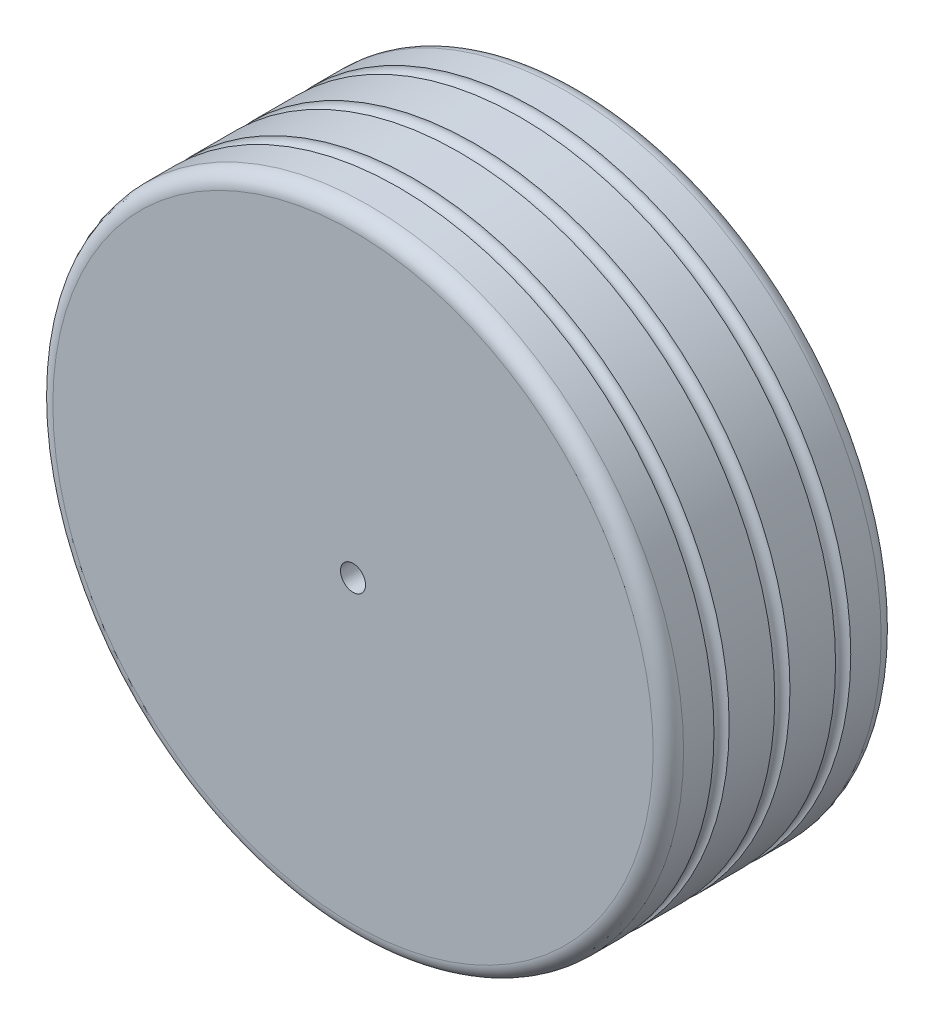
ISO-10303-21;
HEADER;
FILE_DESCRIPTION(('STEP AP214'),'2;1');
FILE_NAME('part.step','',(''),(''),'','','');
FILE_SCHEMA(('AUTOMOTIVE_DESIGN { 1 0 10303 214 1 1 1 1 }'));
ENDSEC;
DATA;
#1=APPLICATION_CONTEXT('core data for automotive mechanical design processes');
#2=APPLICATION_PROTOCOL_DEFINITION('international standard','automotive_design',2000,#1);
#3=PRODUCT_CONTEXT('',#1,'mechanical');
#4=PRODUCT('Part','Part','',(#3));
#5=PRODUCT_RELATED_PRODUCT_CATEGORY('part','',(#4));
#6=PRODUCT_DEFINITION_FORMATION('','',#4);
#7=PRODUCT_DEFINITION_CONTEXT('part definition',#1,'design');
#8=PRODUCT_DEFINITION('design','',#6,#7);
#9=PRODUCT_DEFINITION_SHAPE('','',#8);
#10=(LENGTH_UNIT() NAMED_UNIT(*) SI_UNIT(.MILLI.,.METRE.));
#11=(NAMED_UNIT(*) PLANE_ANGLE_UNIT() SI_UNIT($,.RADIAN.));
#12=(NAMED_UNIT(*) SI_UNIT($,.STERADIAN.) SOLID_ANGLE_UNIT());
#13=UNCERTAINTY_MEASURE_WITH_UNIT(LENGTH_MEASURE(1.E-05),#10,'distance_accuracy_value','');
#14=(GEOMETRIC_REPRESENTATION_CONTEXT(3) GLOBAL_UNCERTAINTY_ASSIGNED_CONTEXT((#13)) GLOBAL_UNIT_ASSIGNED_CONTEXT((#10,
#11,#12)) REPRESENTATION_CONTEXT('',''));
#15=CARTESIAN_POINT('',(0.,0.,0.));
#16=DIRECTION('',(0.,0.,1.));
#17=DIRECTION('',(1.,0.,0.));
#18=AXIS2_PLACEMENT_3D('',#15,#16,#17);
#19=CARTESIAN_POINT('',(0.,0.,30.));
#20=DIRECTION('',(0.,0.,-1.));
#21=DIRECTION('',(-1.,0.,0.));
#22=AXIS2_PLACEMENT_3D('',#19,#20,#21);
#23=CYLINDRICAL_SURFACE('',#22,41.5);
#24=CARTESIAN_POINT('',(0.,0.,22.));
#25=DIRECTION('',(0.,0.,1.));
#26=DIRECTION('',(1.,0.,0.));
#27=AXIS2_PLACEMENT_3D('',#24,#25,#26);
#28=CIRCLE('',#27,41.5);
#29=CARTESIAN_POINT('',(41.5,0.,22.));
#30=VERTEX_POINT('',#29);
#31=EDGE_CURVE('E39',#30,#30,#28,.F.);
#32=ORIENTED_EDGE('',*,*,#31,.T.);
#33=EDGE_LOOP('',(#32));
#34=FACE_BOUND('',#33,.T.);
#35=CARTESIAN_POINT('',(0.,0.,16.));
#36=DIRECTION('',(0.,0.,-1.));
#37=DIRECTION('',(-1.,0.,0.));
#38=AXIS2_PLACEMENT_3D('',#35,#36,#37);
#39=CIRCLE('',#38,41.5);
#40=CARTESIAN_POINT('',(-41.5,0.,16.));
#41=VERTEX_POINT('',#40);
#42=EDGE_CURVE('E60',#41,#41,#39,.F.);
#43=ORIENTED_EDGE('',*,*,#42,.T.);
#44=EDGE_LOOP('',(#43));
#45=FACE_BOUND('',#44,.T.);
#46=ADVANCED_FACE('F35',(#34,#45),#23,.T.);
#47=CARTESIAN_POINT('',(0.,0.,14.));
#48=DIRECTION('',(0.,0.,1.));
#49=DIRECTION('',(1.,0.,0.));
#50=AXIS2_PLACEMENT_3D('',#47,#48,#49);
#51=CIRCLE('',#50,41.5);
#52=CARTESIAN_POINT('',(41.5,0.,14.));
#53=VERTEX_POINT('',#52);
#54=EDGE_CURVE('E56',#53,#53,#51,.F.);
#55=ORIENTED_EDGE('',*,*,#54,.T.);
#56=EDGE_LOOP('',(#55));
#57=FACE_BOUND('',#56,.T.);
#58=CARTESIAN_POINT('',(0.,0.,8.));
#59=DIRECTION('',(0.,0.,-1.));
#60=DIRECTION('',(-1.,0.,0.));
#61=AXIS2_PLACEMENT_3D('',#58,#59,#60);
#62=CIRCLE('',#61,41.5);
#63=CARTESIAN_POINT('',(-41.5,0.,8.));
#64=VERTEX_POINT('',#63);
#65=EDGE_CURVE('E52',#64,#64,#62,.F.);
#66=ORIENTED_EDGE('',*,*,#65,.T.);
#67=EDGE_LOOP('',(#66));
#68=FACE_BOUND('',#67,.T.);
#69=ADVANCED_FACE('F90',(#57,#68),#23,.T.);
#70=CARTESIAN_POINT('',(0.,0.,6.));
#71=DIRECTION('',(0.,0.,1.));
#72=DIRECTION('',(1.,0.,0.));
#73=AXIS2_PLACEMENT_3D('',#70,#71,#72);
#74=CIRCLE('',#73,41.5);
#75=CARTESIAN_POINT('',(41.5,0.,6.));
#76=VERTEX_POINT('',#75);
#77=EDGE_CURVE('E55',#76,#76,#74,.F.);
#78=ORIENTED_EDGE('',*,*,#77,.T.);
#79=EDGE_LOOP('',(#78));
#80=FACE_BOUND('',#79,.T.);
#81=CARTESIAN_POINT('',(0.,0.,2.));
#82=DIRECTION('',(0.,0.,1.));
#83=DIRECTION('',(1.,0.,0.));
#84=AXIS2_PLACEMENT_3D('',#81,#82,#83);
#85=CIRCLE('',#84,41.5);
#86=CARTESIAN_POINT('',(41.5,0.,2.));
#87=VERTEX_POINT('',#86);
#88=EDGE_CURVE('E123',#87,#87,#85,.T.);
#89=ORIENTED_EDGE('',*,*,#88,.T.);
#90=EDGE_LOOP('',(#89));
#91=FACE_BOUND('',#90,.T.);
#92=ADVANCED_FACE('F97',(#80,#91),#23,.T.);
#93=CARTESIAN_POINT('',(0.,0.,0.));
#94=DIRECTION('',(0.,0.,1.));
#95=DIRECTION('',(1.,0.,0.));
#96=AXIS2_PLACEMENT_3D('',#93,#94,#95);
#97=PLANE('',#96);
#98=CARTESIAN_POINT('',(0.,0.,0.));
#99=DIRECTION('',(0.,0.,1.));
#100=DIRECTION('',(1.,0.,0.));
#101=AXIS2_PLACEMENT_3D('',#98,#99,#100);
#102=CIRCLE('',#101,28.);
#103=CARTESIAN_POINT('',(28.,0.,0.));
#104=VERTEX_POINT('',#103);
#105=EDGE_CURVE('E43',#104,#104,#102,.T.);
#106=ORIENTED_EDGE('',*,*,#105,.T.);
#107=EDGE_LOOP('',(#106));
#108=FACE_BOUND('',#107,.T.);
#109=CARTESIAN_POINT('',(0.,0.,0.));
#110=DIRECTION('',(0.,0.,1.));
#111=DIRECTION('',(1.,0.,0.));
#112=AXIS2_PLACEMENT_3D('',#109,#110,#111);
#113=CIRCLE('',#112,39.5);
#114=CARTESIAN_POINT('',(39.5,0.,0.));
#115=VERTEX_POINT('',#114);
#116=EDGE_CURVE('E125',#115,#115,#113,.F.);
#117=ORIENTED_EDGE('',*,*,#116,.T.);
#118=EDGE_LOOP('',(#117));
#119=FACE_BOUND('',#118,.T.);
#120=ADVANCED_FACE('F111',(#108,#119),#97,.F.);
#121=CARTESIAN_POINT('',(0.,0.,2.));
#122=DIRECTION('',(0.,0.,1.));
#123=DIRECTION('',(1.,0.,0.));
#124=AXIS2_PLACEMENT_3D('',#121,#122,#123);
#125=TOROIDAL_SURFACE('',#124,39.5,2.);
#126=ORIENTED_EDGE('',*,*,#116,.F.);
#127=EDGE_LOOP('',(#126));
#128=FACE_BOUND('',#127,.T.);
#129=ORIENTED_EDGE('',*,*,#88,.F.);
#130=EDGE_LOOP('',(#129));
#131=FACE_BOUND('',#130,.T.);
#132=ADVANCED_FACE('F117',(#128,#131),#125,.T.);
#133=CARTESIAN_POINT('',(0.,0.,10.));
#134=DIRECTION('',(0.,0.,-1.));
#135=DIRECTION('',(-1.,0.,0.));
#136=AXIS2_PLACEMENT_3D('',#133,#134,#135);
#137=CYLINDRICAL_SURFACE('',#136,25.);
#138=CARTESIAN_POINT('',(0.,0.,3.));
#139=DIRECTION('',(0.,0.,1.));
#140=DIRECTION('',(1.,0.,0.));
#141=AXIS2_PLACEMENT_3D('',#138,#139,#140);
#142=CIRCLE('',#141,25.);
#143=CARTESIAN_POINT('',(25.,0.,3.));
#144=VERTEX_POINT('',#143);
#145=EDGE_CURVE('E48',#144,#144,#142,.F.);
#146=ORIENTED_EDGE('',*,*,#145,.T.);
#147=EDGE_LOOP('',(#146));
#148=FACE_BOUND('',#147,.T.);
#149=CARTESIAN_POINT('',(0.,0.,7.));
#150=DIRECTION('',(0.,0.,-1.));
#151=DIRECTION('',(-1.,0.,0.));
#152=AXIS2_PLACEMENT_3D('',#149,#150,#151);
#153=CIRCLE('',#152,25.);
#154=CARTESIAN_POINT('',(-25.,0.,7.));
#155=VERTEX_POINT('',#154);
#156=EDGE_CURVE('E138',#155,#155,#153,.F.);
#157=ORIENTED_EDGE('',*,*,#156,.T.);
#158=EDGE_LOOP('',(#157));
#159=FACE_BOUND('',#158,.T.);
#160=ADVANCED_FACE('F143',(#148,#159),#137,.F.);
#161=CARTESIAN_POINT('',(0.,0.,10.));
#162=DIRECTION('',(0.,0.,-1.));
#163=DIRECTION('',(-1.,0.,0.));
#164=AXIS2_PLACEMENT_3D('',#161,#162,#163);
#165=PLANE('',#164);
#166=CARTESIAN_POINT('',(0.,0.,10.));
#167=DIRECTION('',(0.,0.,-1.));
#168=DIRECTION('',(-1.,0.,0.));
#169=AXIS2_PLACEMENT_3D('',#166,#167,#168);
#170=CIRCLE('',#169,22.);
#171=CARTESIAN_POINT('',(-22.,0.,10.));
#172=VERTEX_POINT('',#171);
#173=EDGE_CURVE('E10',#172,#172,#170,.T.);
#174=ORIENTED_EDGE('',*,*,#173,.T.);
#175=EDGE_LOOP('',(#174));
#176=FACE_BOUND('',#175,.T.);
#177=ADVANCED_FACE('F148',(#176),#165,.T.);
#178=CARTESIAN_POINT('',(0.,0.,3.));
#179=DIRECTION('',(0.,0.,1.));
#180=DIRECTION('',(1.,0.,0.));
#181=AXIS2_PLACEMENT_3D('',#178,#179,#180);
#182=TOROIDAL_SURFACE('',#181,28.,3.);
#183=ORIENTED_EDGE('',*,*,#105,.F.);
#184=EDGE_LOOP('',(#183));
#185=FACE_BOUND('',#184,.T.);
#186=ORIENTED_EDGE('',*,*,#145,.F.);
#187=EDGE_LOOP('',(#186));
#188=FACE_BOUND('',#187,.T.);
#189=ADVANCED_FACE('F146',(#185,#188),#182,.T.);
#190=CARTESIAN_POINT('',(0.,0.,7.));
#191=DIRECTION('',(0.,0.,-1.));
#192=DIRECTION('',(-1.,0.,0.));
#193=AXIS2_PLACEMENT_3D('',#190,#191,#192);
#194=TOROIDAL_SURFACE('',#193,22.,3.);
#195=ORIENTED_EDGE('',*,*,#156,.F.);
#196=EDGE_LOOP('',(#195));
#197=FACE_BOUND('',#196,.T.);
#198=ORIENTED_EDGE('',*,*,#173,.F.);
#199=EDGE_LOOP('',(#198));
#200=FACE_BOUND('',#199,.T.);
#201=ADVANCED_FACE('F37',(#197,#200),#194,.F.);
#202=CARTESIAN_POINT('',(0.,0.,7.));
#203=DIRECTION('',(0.,0.,-1.));
#204=DIRECTION('',(-1.,0.,0.));
#205=AXIS2_PLACEMENT_3D('',#202,#203,#204);
#206=TOROIDAL_SURFACE('',#205,41.5,1.);
#207=ORIENTED_EDGE('',*,*,#65,.F.);
#208=EDGE_LOOP('',(#207));
#209=FACE_BOUND('',#208,.T.);
#210=ORIENTED_EDGE('',*,*,#77,.F.);
#211=EDGE_LOOP('',(#210));
#212=FACE_BOUND('',#211,.T.);
#213=ADVANCED_FACE('F86',(#209,#212),#206,.F.);
#214=CARTESIAN_POINT('',(0.,0.,15.));
#215=DIRECTION('',(0.,0.,-1.));
#216=DIRECTION('',(-1.,0.,0.));
#217=AXIS2_PLACEMENT_3D('',#214,#215,#216);
#218=TOROIDAL_SURFACE('',#217,41.5,1.);
#219=ORIENTED_EDGE('',*,*,#42,.F.);
#220=EDGE_LOOP('',(#219));
#221=FACE_BOUND('',#220,.T.);
#222=ORIENTED_EDGE('',*,*,#54,.F.);
#223=EDGE_LOOP('',(#222));
#224=FACE_BOUND('',#223,.T.);
#225=ADVANCED_FACE('F76',(#221,#224),#218,.F.);
#226=CARTESIAN_POINT('',(0.,0.,23.));
#227=DIRECTION('',(0.,0.,-1.));
#228=DIRECTION('',(-1.,0.,0.));
#229=AXIS2_PLACEMENT_3D('',#226,#227,#228);
#230=TOROIDAL_SURFACE('',#229,41.5,1.);
#231=CARTESIAN_POINT('',(0.,0.,24.));
#232=DIRECTION('',(0.,0.,-1.));
#233=DIRECTION('',(-1.,0.,0.));
#234=AXIS2_PLACEMENT_3D('',#231,#232,#233);
#235=CIRCLE('',#234,41.5);
#236=CARTESIAN_POINT('',(-41.5,0.,24.));
#237=VERTEX_POINT('',#236);
#238=EDGE_CURVE('E64',#237,#237,#235,.F.);
#239=ORIENTED_EDGE('',*,*,#238,.F.);
#240=EDGE_LOOP('',(#239));
#241=FACE_BOUND('',#240,.T.);
#242=ORIENTED_EDGE('',*,*,#31,.F.);
#243=EDGE_LOOP('',(#242));
#244=FACE_BOUND('',#243,.T.);
#245=ADVANCED_FACE('F73',(#241,#244),#230,.F.);
#246=CARTESIAN_POINT('',(0.,0.,23.));
#247=DIRECTION('',(0.,0.,1.));
#248=DIRECTION('',(1.,0.,0.));
#249=AXIS2_PLACEMENT_3D('',#246,#247,#248);
#250=PLANE('',#249);
#251=CARTESIAN_POINT('',(0.,0.,23.));
#252=DIRECTION('',(0.,0.,1.));
#253=DIRECTION('',(1.,0.,0.));
#254=AXIS2_PLACEMENT_3D('',#251,#252,#253);
#255=CIRCLE('',#254,1.65);
#256=CARTESIAN_POINT('',(1.65,0.,23.));
#257=VERTEX_POINT('',#256);
#258=EDGE_CURVE('E132',#257,#257,#255,.T.);
#259=ORIENTED_EDGE('',*,*,#258,.T.);
#260=EDGE_LOOP('',(#259));
#261=FACE_BOUND('',#260,.T.);
#262=ADVANCED_FACE('F75',(#261),#250,.T.);
#263=CARTESIAN_POINT('',(0.,0.,23.));
#264=DIRECTION('',(0.,0.,1.));
#265=DIRECTION('',(1.,0.,0.));
#266=AXIS2_PLACEMENT_3D('',#263,#264,#265);
#267=CYLINDRICAL_SURFACE('',#266,1.65);
#268=ORIENTED_EDGE('',*,*,#258,.F.);
#269=EDGE_LOOP('',(#268));
#270=FACE_BOUND('',#269,.T.);
#271=CARTESIAN_POINT('',(0.,0.,30.));
#272=DIRECTION('',(0.,0.,1.));
#273=DIRECTION('',(1.,0.,0.));
#274=AXIS2_PLACEMENT_3D('',#271,#272,#273);
#275=CIRCLE('',#274,1.65);
#276=CARTESIAN_POINT('',(1.65,0.,30.));
#277=VERTEX_POINT('',#276);
#278=EDGE_CURVE('E59',#277,#277,#275,.T.);
#279=ORIENTED_EDGE('',*,*,#278,.T.);
#280=EDGE_LOOP('',(#279));
#281=FACE_BOUND('',#280,.T.);
#282=ADVANCED_FACE('F83',(#270,#281),#267,.F.);
#283=CARTESIAN_POINT('',(0.,0.,30.));
#284=DIRECTION('',(0.,0.,1.));
#285=DIRECTION('',(1.,0.,0.));
#286=AXIS2_PLACEMENT_3D('',#283,#284,#285);
#287=PLANE('',#286);
#288=ORIENTED_EDGE('',*,*,#278,.F.);
#289=EDGE_LOOP('',(#288));
#290=FACE_BOUND('',#289,.T.);
#291=CARTESIAN_POINT('',(0.,0.,30.));
#292=DIRECTION('',(0.,0.,1.));
#293=DIRECTION('',(1.,0.,0.));
#294=AXIS2_PLACEMENT_3D('',#291,#292,#293);
#295=CIRCLE('',#294,39.5);
#296=CARTESIAN_POINT('',(39.5,0.,30.));
#297=VERTEX_POINT('',#296);
#298=EDGE_CURVE('E129',#297,#297,#295,.T.);
#299=ORIENTED_EDGE('',*,*,#298,.T.);
#300=EDGE_LOOP('',(#299));
#301=FACE_BOUND('',#300,.T.);
#302=ADVANCED_FACE('F106',(#290,#301),#287,.T.);
#303=CARTESIAN_POINT('',(0.,0.,28.));
#304=DIRECTION('',(0.,0.,1.));
#305=DIRECTION('',(1.,0.,0.));
#306=AXIS2_PLACEMENT_3D('',#303,#304,#305);
#307=TOROIDAL_SURFACE('',#306,39.5,2.);
#308=CARTESIAN_POINT('',(0.,0.,28.));
#309=DIRECTION('',(0.,0.,1.));
#310=DIRECTION('',(1.,0.,0.));
#311=AXIS2_PLACEMENT_3D('',#308,#309,#310);
#312=CIRCLE('',#311,41.5);
#313=CARTESIAN_POINT('',(41.5,0.,28.));
#314=VERTEX_POINT('',#313);
#315=EDGE_CURVE('E126',#314,#314,#312,.F.);
#316=ORIENTED_EDGE('',*,*,#315,.F.);
#317=EDGE_LOOP('',(#316));
#318=FACE_BOUND('',#317,.T.);
#319=ORIENTED_EDGE('',*,*,#298,.F.);
#320=EDGE_LOOP('',(#319));
#321=FACE_BOUND('',#320,.T.);
#322=ADVANCED_FACE('F102',(#318,#321),#307,.T.);
#323=ORIENTED_EDGE('',*,*,#238,.T.);
#324=EDGE_LOOP('',(#323));
#325=FACE_BOUND('',#324,.T.);
#326=ORIENTED_EDGE('',*,*,#315,.T.);
#327=EDGE_LOOP('',(#326));
#328=FACE_BOUND('',#327,.T.);
#329=ADVANCED_FACE('F92',(#325,#328),#23,.T.);
#330=CLOSED_SHELL('',(#46,#69,#92,#120,#132,#160,#177,#189,#201,#213,#225,#245,#262,#282,#302,
#322,#329));
#331=MANIFOLD_SOLID_BREP('B2',#330);
#332=ADVANCED_BREP_SHAPE_REPRESENTATION('',(#18,#331),#14);
#333=SHAPE_DEFINITION_REPRESENTATION(#9,#332);
ENDSEC;
END-ISO-10303-21;
